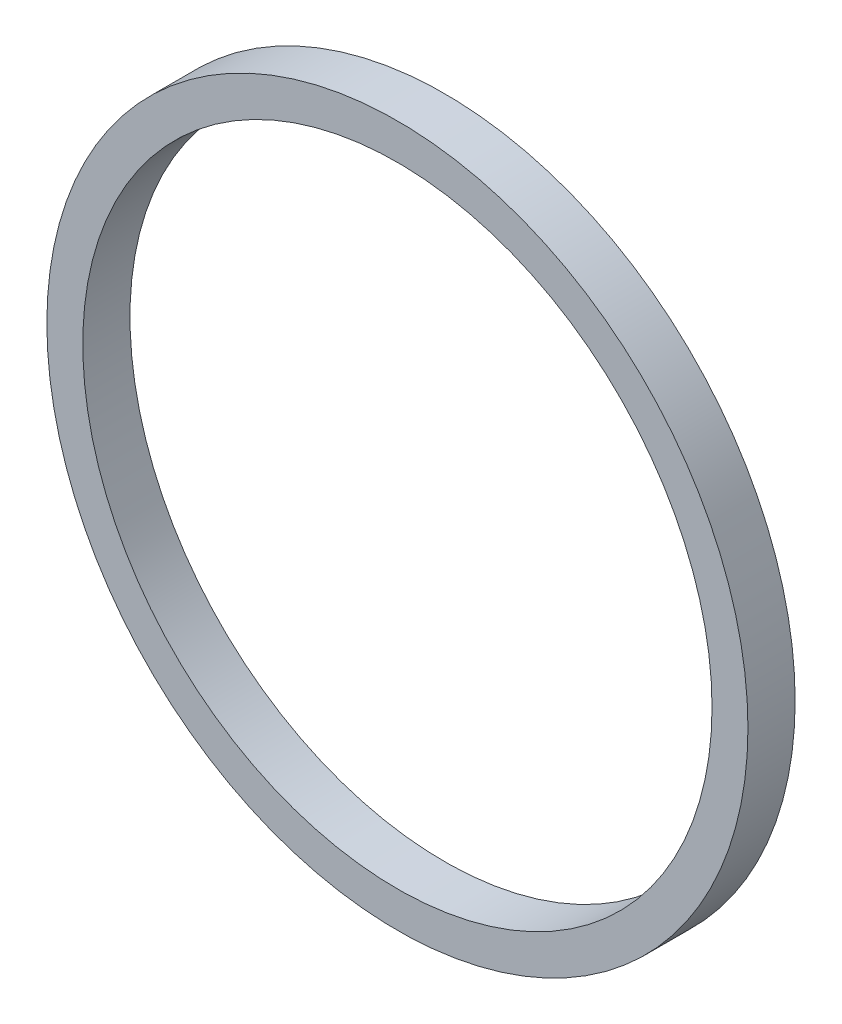
ISO-10303-21;
HEADER;
FILE_DESCRIPTION(('STEP AP214'),'2;1');
FILE_NAME('part.step','',(''),(''),'','','');
FILE_SCHEMA(('AUTOMOTIVE_DESIGN { 1 0 10303 214 1 1 1 1 }'));
ENDSEC;
DATA;
#1=APPLICATION_CONTEXT('core data for automotive mechanical design processes');
#2=APPLICATION_PROTOCOL_DEFINITION('international standard','automotive_design',2000,#1);
#3=PRODUCT_CONTEXT('',#1,'mechanical');
#4=PRODUCT('Part','Part','',(#3));
#5=PRODUCT_RELATED_PRODUCT_CATEGORY('part','',(#4));
#6=PRODUCT_DEFINITION_FORMATION('','',#4);
#7=PRODUCT_DEFINITION_CONTEXT('part definition',#1,'design');
#8=PRODUCT_DEFINITION('design','',#6,#7);
#9=PRODUCT_DEFINITION_SHAPE('','',#8);
#10=(LENGTH_UNIT() NAMED_UNIT(*) SI_UNIT(.MILLI.,.METRE.));
#11=(NAMED_UNIT(*) PLANE_ANGLE_UNIT() SI_UNIT($,.RADIAN.));
#12=(NAMED_UNIT(*) SI_UNIT($,.STERADIAN.) SOLID_ANGLE_UNIT());
#13=UNCERTAINTY_MEASURE_WITH_UNIT(LENGTH_MEASURE(1.E-05),#10,'distance_accuracy_value','');
#14=(GEOMETRIC_REPRESENTATION_CONTEXT(3) GLOBAL_UNCERTAINTY_ASSIGNED_CONTEXT((#13)) GLOBAL_UNIT_ASSIGNED_CONTEXT((#10,
#11,#12)) REPRESENTATION_CONTEXT('',''));
#15=CARTESIAN_POINT('',(0.,0.,0.));
#16=DIRECTION('',(0.,0.,1.));
#17=DIRECTION('',(1.,0.,0.));
#18=AXIS2_PLACEMENT_3D('',#15,#16,#17);
#19=CARTESIAN_POINT('',(0.,0.,19.05));
#20=DIRECTION('',(0.,0.,1.));
#21=DIRECTION('',(1.,0.,0.));
#22=AXIS2_PLACEMENT_3D('',#19,#20,#21);
#23=PLANE('',#22);
#24=CARTESIAN_POINT('',(0.,0.,19.05));
#25=DIRECTION('',(0.,0.,1.));
#26=DIRECTION('',(1.,0.,0.));
#27=AXIS2_PLACEMENT_3D('',#24,#25,#26);
#28=CIRCLE('',#27,141.5);
#29=CARTESIAN_POINT('',(141.5,0.,19.05));
#30=VERTEX_POINT('',#29);
#31=EDGE_CURVE('E10',#30,#30,#28,.T.);
#32=ORIENTED_EDGE('',*,*,#31,.T.);
#33=EDGE_LOOP('',(#32));
#34=FACE_BOUND('',#33,.T.);
#35=CARTESIAN_POINT('',(0.,0.,19.05));
#36=DIRECTION('',(0.,0.,1.));
#37=DIRECTION('',(1.,0.,0.));
#38=AXIS2_PLACEMENT_3D('',#35,#36,#37);
#39=CIRCLE('',#38,127.);
#40=CARTESIAN_POINT('',(127.,0.,19.05));
#41=VERTEX_POINT('',#40);
#42=EDGE_CURVE('E42',#41,#41,#39,.T.);
#43=ORIENTED_EDGE('',*,*,#42,.F.);
#44=EDGE_LOOP('',(#43));
#45=FACE_BOUND('',#44,.T.);
#46=ADVANCED_FACE('F31',(#34,#45),#23,.T.);
#47=CARTESIAN_POINT('',(0.,0.,0.));
#48=DIRECTION('',(0.,0.,1.));
#49=DIRECTION('',(1.,0.,0.));
#50=AXIS2_PLACEMENT_3D('',#47,#48,#49);
#51=PLANE('',#50);
#52=CARTESIAN_POINT('',(0.,0.,0.));
#53=DIRECTION('',(0.,0.,1.));
#54=DIRECTION('',(1.,0.,0.));
#55=AXIS2_PLACEMENT_3D('',#52,#53,#54);
#56=CIRCLE('',#55,141.5);
#57=CARTESIAN_POINT('',(141.5,0.,0.));
#58=VERTEX_POINT('',#57);
#59=EDGE_CURVE('E35',#58,#58,#56,.T.);
#60=ORIENTED_EDGE('',*,*,#59,.F.);
#61=EDGE_LOOP('',(#60));
#62=FACE_BOUND('',#61,.T.);
#63=CARTESIAN_POINT('',(0.,0.,0.));
#64=DIRECTION('',(0.,0.,1.));
#65=DIRECTION('',(1.,0.,0.));
#66=AXIS2_PLACEMENT_3D('',#63,#64,#65);
#67=CIRCLE('',#66,127.);
#68=CARTESIAN_POINT('',(127.,0.,0.));
#69=VERTEX_POINT('',#68);
#70=EDGE_CURVE('E44',#69,#69,#67,.T.);
#71=ORIENTED_EDGE('',*,*,#70,.T.);
#72=EDGE_LOOP('',(#71));
#73=FACE_BOUND('',#72,.T.);
#74=ADVANCED_FACE('F54',(#62,#73),#51,.F.);
#75=CARTESIAN_POINT('',(0.,0.,19.05));
#76=DIRECTION('',(0.,0.,-1.));
#77=DIRECTION('',(-1.,0.,0.));
#78=AXIS2_PLACEMENT_3D('',#75,#76,#77);
#79=CYLINDRICAL_SURFACE('',#78,141.5);
#80=ORIENTED_EDGE('',*,*,#31,.F.);
#81=EDGE_LOOP('',(#80));
#82=FACE_BOUND('',#81,.T.);
#83=ORIENTED_EDGE('',*,*,#59,.T.);
#84=EDGE_LOOP('',(#83));
#85=FACE_BOUND('',#84,.T.);
#86=ADVANCED_FACE('F33',(#82,#85),#79,.T.);
#87=CARTESIAN_POINT('',(0.,0.,19.05));
#88=DIRECTION('',(0.,0.,-1.));
#89=DIRECTION('',(-1.,0.,0.));
#90=AXIS2_PLACEMENT_3D('',#87,#88,#89);
#91=CYLINDRICAL_SURFACE('',#90,127.);
#92=ORIENTED_EDGE('',*,*,#42,.T.);
#93=EDGE_LOOP('',(#92));
#94=FACE_BOUND('',#93,.T.);
#95=ORIENTED_EDGE('',*,*,#70,.F.);
#96=EDGE_LOOP('',(#95));
#97=FACE_BOUND('',#96,.T.);
#98=ADVANCED_FACE('F50',(#94,#97),#91,.F.);
#99=CLOSED_SHELL('',(#46,#74,#86,#98));
#100=MANIFOLD_SOLID_BREP('B2',#99);
#101=ADVANCED_BREP_SHAPE_REPRESENTATION('',(#18,#100),#14);
#102=SHAPE_DEFINITION_REPRESENTATION(#9,#101);
ENDSEC;
END-ISO-10303-21;
